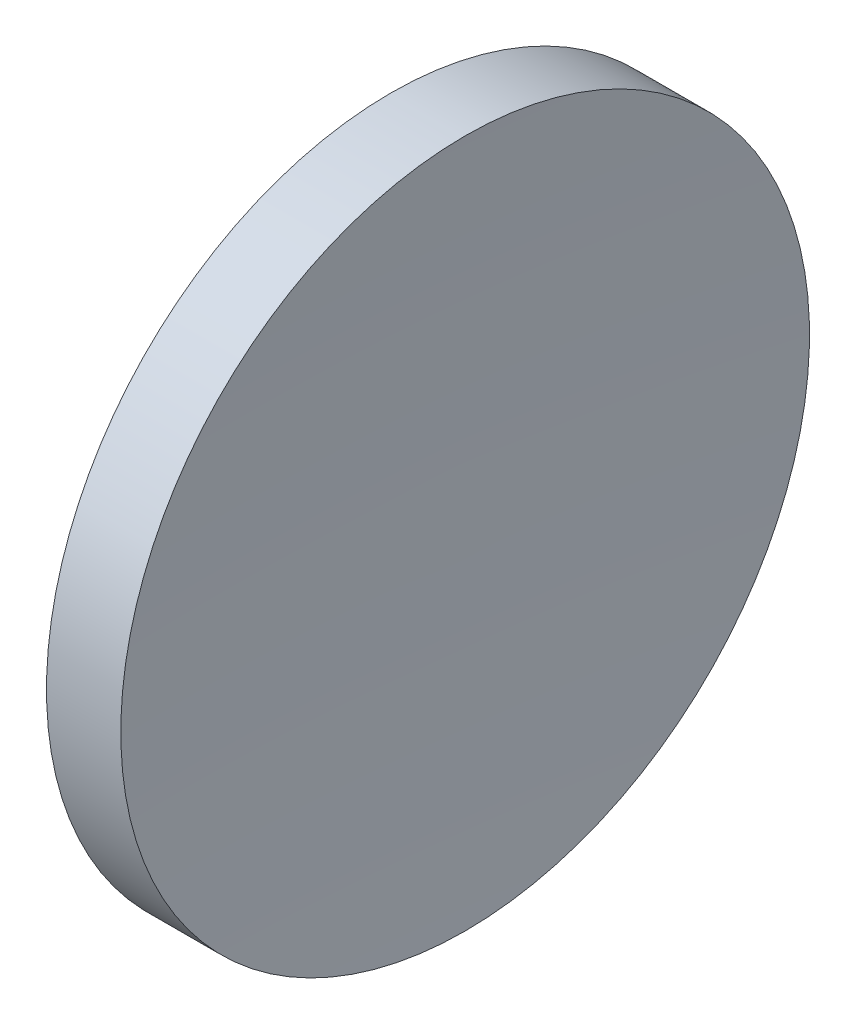
ISO-10303-21;
HEADER;
FILE_DESCRIPTION(('STEP AP214'),'2;1');
FILE_NAME('part.step','',(''),(''),'','','');
FILE_SCHEMA(('AUTOMOTIVE_DESIGN { 1 0 10303 214 1 1 1 1 }'));
ENDSEC;
DATA;
#1=APPLICATION_CONTEXT('core data for automotive mechanical design processes');
#2=APPLICATION_PROTOCOL_DEFINITION('international standard','automotive_design',2000,#1);
#3=PRODUCT_CONTEXT('',#1,'mechanical');
#4=PRODUCT('Part','Part','',(#3));
#5=PRODUCT_RELATED_PRODUCT_CATEGORY('part','',(#4));
#6=PRODUCT_DEFINITION_FORMATION('','',#4);
#7=PRODUCT_DEFINITION_CONTEXT('part definition',#1,'design');
#8=PRODUCT_DEFINITION('design','',#6,#7);
#9=PRODUCT_DEFINITION_SHAPE('','',#8);
#10=(LENGTH_UNIT() NAMED_UNIT(*) SI_UNIT(.MILLI.,.METRE.));
#11=(NAMED_UNIT(*) PLANE_ANGLE_UNIT() SI_UNIT($,.RADIAN.));
#12=(NAMED_UNIT(*) SI_UNIT($,.STERADIAN.) SOLID_ANGLE_UNIT());
#13=UNCERTAINTY_MEASURE_WITH_UNIT(LENGTH_MEASURE(1.E-05),#10,'distance_accuracy_value','');
#14=(GEOMETRIC_REPRESENTATION_CONTEXT(3) GLOBAL_UNCERTAINTY_ASSIGNED_CONTEXT((#13)) GLOBAL_UNIT_ASSIGNED_CONTEXT((#10,
#11,#12)) REPRESENTATION_CONTEXT('',''));
#15=CARTESIAN_POINT('',(0.,0.,0.));
#16=DIRECTION('',(0.,0.,1.));
#17=DIRECTION('',(1.,0.,0.));
#18=AXIS2_PLACEMENT_3D('',#15,#16,#17);
#19=CARTESIAN_POINT('',(308.090339191623,51.9678068313558,0.));
#20=DIRECTION('',(0.,0.,-1.));
#21=DIRECTION('',(0.,-1.,0.));
#22=AXIS2_PLACEMENT_3D('',#19,#20,#21);
#23=CIRCLE('',#22,211.);
#24=TRIMMED_CURVE('',#23,(PARAMETER_VALUE(-1.57179289315433)),
(PARAMETER_VALUE(1.57179289315433)),.T.,.PARAMETER.);
#25=CARTESIAN_POINT('',(308.090339191623,52.17808229839,0.));
#26=DIRECTION('',(-1.,0.,0.));
#27=AXIS1_PLACEMENT('',#25,#26);
#28=SURFACE_OF_REVOLUTION('',#24,#27);
#29=CARTESIAN_POINT('',(97.4603157355861,52.1780822983899,0.));
#30=DIRECTION('',(-1.,0.,0.));
#31=DIRECTION('',(0.,-1.,0.));
#32=AXIS2_PLACEMENT_3D('',#29,#30,#31);
#33=CIRCLE('',#32,12.7);
#34=CARTESIAN_POINT('',(97.4603157355861,39.4780822983899,0.));
#35=VERTEX_POINT('',#34);
#36=EDGE_CURVE('E11',#35,#35,#33,.T.);
#37=ORIENTED_EDGE('',*,*,#36,.F.);
#38=EDGE_LOOP('',(#37));
#39=FACE_BOUND('',#38,.T.);
#40=CARTESIAN_POINT('',(97.0904439683599,52.1780822983899,0.));
#41=VERTEX_POINT('',#40);
#42=VERTEX_LOOP('',#41);
#43=FACE_BOUND('',#42,.T.);
#44=ADVANCED_FACE('F37',(#39,#43),#28,.F.);
#45=CARTESIAN_POINT('',(89.8586564536171,52.1780822983899,0.));
#46=DIRECTION('',(-1.,0.,0.));
#47=DIRECTION('',(0.,-1.,0.));
#48=AXIS2_PLACEMENT_3D('',#45,#46,#47);
#49=CYLINDRICAL_SURFACE('',#48,12.7);
#50=CARTESIAN_POINT('',(94.7205722011337,52.1780822983899,0.));
#51=DIRECTION('',(-1.,0.,0.));
#52=DIRECTION('',(0.,-1.,0.));
#53=AXIS2_PLACEMENT_3D('',#50,#51,#52);
#54=CIRCLE('',#53,12.7000000000001);
#55=CARTESIAN_POINT('',(94.7205722011337,39.4780822983898,0.));
#56=VERTEX_POINT('',#55);
#57=EDGE_CURVE('E44',#56,#56,#54,.T.);
#58=ORIENTED_EDGE('',*,*,#57,.F.);
#59=EDGE_LOOP('',(#58));
#60=FACE_BOUND('',#59,.T.);
#61=ORIENTED_EDGE('',*,*,#36,.T.);
#62=EDGE_LOOP('',(#61));
#63=FACE_BOUND('',#62,.T.);
#64=ADVANCED_FACE('F53',(#60,#63),#49,.T.);
#65=CARTESIAN_POINT('',(-115.909451254903,51.9678068313559,0.));
#66=DIRECTION('',(0.,0.,-1.));
#67=DIRECTION('',(0.,-1.,0.));
#68=AXIS2_PLACEMENT_3D('',#65,#66,#67);
#69=CIRCLE('',#68,211.);
#70=TRIMMED_CURVE('',#69,(PARAMETER_VALUE(-1.57179289315433)),
(PARAMETER_VALUE(1.57179289315433)),.T.,.PARAMETER.);
#71=CARTESIAN_POINT('',(-115.909451254903,52.1780822983898,0.));
#72=DIRECTION('',(-1.,0.,0.));
#73=AXIS1_PLACEMENT('',#71,#72);
#74=SURFACE_OF_REVOLUTION('',#70,#73);
#75=CARTESIAN_POINT('',(95.0904439683599,52.1780822983899,0.));
#76=VERTEX_POINT('',#75);
#77=VERTEX_LOOP('',#76);
#78=FACE_BOUND('',#77,.T.);
#79=ORIENTED_EDGE('',*,*,#57,.T.);
#80=EDGE_LOOP('',(#79));
#81=FACE_BOUND('',#80,.T.);
#82=ADVANCED_FACE('F50',(#78,#81),#74,.F.);
#83=CLOSED_SHELL('',(#44,#64,#82));
#84=MANIFOLD_SOLID_BREP('B2',#83);
#85=ADVANCED_BREP_SHAPE_REPRESENTATION('',(#18,#84),#14);
#86=SHAPE_DEFINITION_REPRESENTATION(#9,#85);
ENDSEC;
END-ISO-10303-21;
